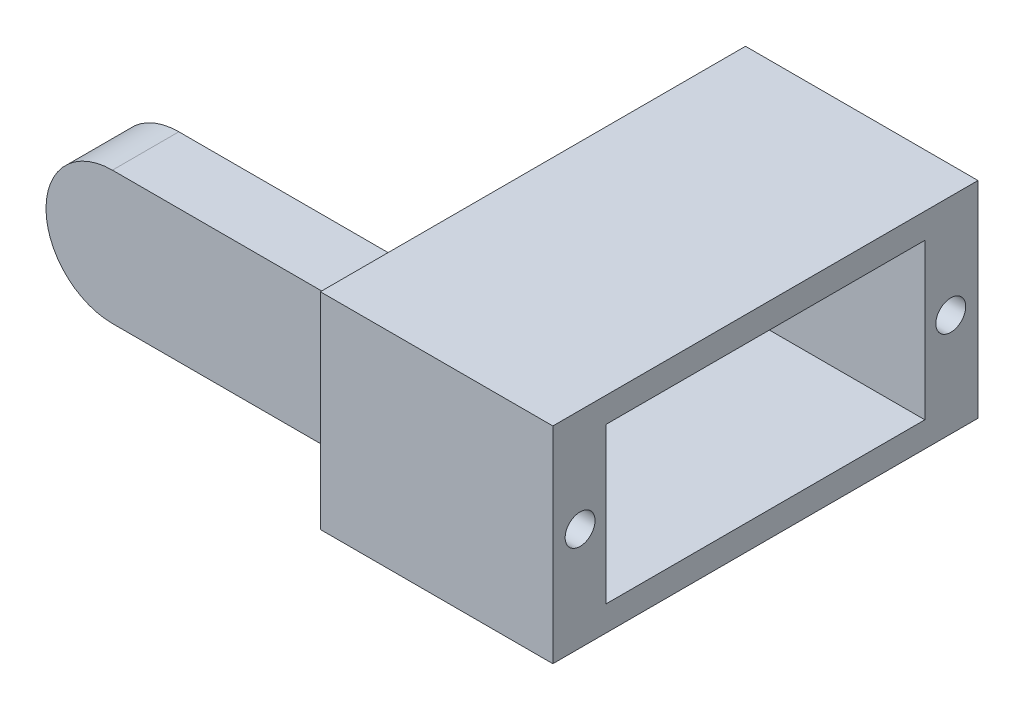
ISO-10303-21;
HEADER;
FILE_DESCRIPTION(('STEP AP214'),'2;1');
FILE_NAME('part.step','',(''),(''),'','','');
FILE_SCHEMA(('AUTOMOTIVE_DESIGN { 1 0 10303 214 1 1 1 1 }'));
ENDSEC;
DATA;
#1=APPLICATION_CONTEXT('core data for automotive mechanical design processes');
#2=APPLICATION_PROTOCOL_DEFINITION('international standard','automotive_design',2000,#1);
#3=PRODUCT_CONTEXT('',#1,'mechanical');
#4=PRODUCT('Part','Part','',(#3));
#5=PRODUCT_RELATED_PRODUCT_CATEGORY('part','',(#4));
#6=PRODUCT_DEFINITION_FORMATION('','',#4);
#7=PRODUCT_DEFINITION_CONTEXT('part definition',#1,'design');
#8=PRODUCT_DEFINITION('design','',#6,#7);
#9=PRODUCT_DEFINITION_SHAPE('','',#8);
#10=(LENGTH_UNIT() NAMED_UNIT(*) SI_UNIT(.MILLI.,.METRE.));
#11=(NAMED_UNIT(*) PLANE_ANGLE_UNIT() SI_UNIT($,.RADIAN.));
#12=(NAMED_UNIT(*) SI_UNIT($,.STERADIAN.) SOLID_ANGLE_UNIT());
#13=UNCERTAINTY_MEASURE_WITH_UNIT(LENGTH_MEASURE(1.E-05),#10,'distance_accuracy_value','');
#14=(GEOMETRIC_REPRESENTATION_CONTEXT(3) GLOBAL_UNCERTAINTY_ASSIGNED_CONTEXT((#13)) GLOBAL_UNIT_ASSIGNED_CONTEXT((#10,
#11,#12)) REPRESENTATION_CONTEXT('',''));
#15=CARTESIAN_POINT('',(0.,0.,0.));
#16=DIRECTION('',(0.,0.,1.));
#17=DIRECTION('',(1.,0.,0.));
#18=AXIS2_PLACEMENT_3D('',#15,#16,#17);
#19=CARTESIAN_POINT('',(0.,-5.,5.));
#20=DIRECTION('',(0.,1.,0.));
#21=DIRECTION('',(0.,0.,1.));
#22=AXIS2_PLACEMENT_3D('',#19,#20,#21);
#23=PLANE('',#22);
#24=DIRECTION('',(0.,0.,-1.));
#25=VECTOR('',#24,1.);
#26=CARTESIAN_POINT('',(18.5,-5.,0.));
#27=LINE('',#26,#25);
#28=CARTESIAN_POINT('',(18.5,-5.,5.));
#29=VERTEX_POINT('',#28);
#30=CARTESIAN_POINT('',(18.5,-5.,0.));
#31=VERTEX_POINT('',#30);
#32=EDGE_CURVE('E180',#29,#31,#27,.T.);
#33=ORIENTED_EDGE('',*,*,#32,.F.);
#34=DIRECTION('',(1.,0.,0.));
#35=VECTOR('',#34,1.);
#36=CARTESIAN_POINT('',(0.,-5.,5.));
#37=LINE('',#36,#35);
#38=CARTESIAN_POINT('',(0.,-5.,5.));
#39=VERTEX_POINT('',#38);
#40=EDGE_CURVE('E201',#39,#29,#37,.T.);
#41=ORIENTED_EDGE('',*,*,#40,.F.);
#42=DIRECTION('',(0.,0.,-1.));
#43=VECTOR('',#42,1.);
#44=CARTESIAN_POINT('',(0.,-5.,5.));
#45=LINE('',#44,#43);
#46=CARTESIAN_POINT('',(0.,-5.,0.));
#47=VERTEX_POINT('',#46);
#48=EDGE_CURVE('E11',#39,#47,#45,.T.);
#49=ORIENTED_EDGE('',*,*,#48,.T.);
#50=DIRECTION('',(1.,0.,0.));
#51=VECTOR('',#50,1.);
#52=CARTESIAN_POINT('',(0.,-5.,0.));
#53=LINE('',#52,#51);
#54=EDGE_CURVE('E208',#47,#31,#53,.T.);
#55=ORIENTED_EDGE('',*,*,#54,.T.);
#56=EDGE_LOOP('',(#33,#41,#49,#55));
#57=FACE_BOUND('',#56,.T.);
#58=ADVANCED_FACE('F38',(#57),#23,.F.);
#59=CARTESIAN_POINT('',(0.,5.,5.));
#60=DIRECTION('',(0.,1.,0.));
#61=DIRECTION('',(0.,0.,1.));
#62=AXIS2_PLACEMENT_3D('',#59,#60,#61);
#63=PLANE('',#62);
#64=DIRECTION('',(1.,0.,0.));
#65=VECTOR('',#64,1.);
#66=CARTESIAN_POINT('',(0.,5.,5.));
#67=LINE('',#66,#65);
#68=CARTESIAN_POINT('',(0.,5.,5.));
#69=VERTEX_POINT('',#68);
#70=CARTESIAN_POINT('',(18.5,5.,5.));
#71=VERTEX_POINT('',#70);
#72=EDGE_CURVE('E204',#69,#71,#67,.T.);
#73=ORIENTED_EDGE('',*,*,#72,.T.);
#74=DIRECTION('',(0.,0.,1.));
#75=VECTOR('',#74,1.);
#76=CARTESIAN_POINT('',(18.5,5.,0.));
#77=LINE('',#76,#75);
#78=CARTESIAN_POINT('',(18.5,5.,0.));
#79=VERTEX_POINT('',#78);
#80=EDGE_CURVE('E141',#79,#71,#77,.T.);
#81=ORIENTED_EDGE('',*,*,#80,.F.);
#82=DIRECTION('',(1.,0.,0.));
#83=VECTOR('',#82,1.);
#84=CARTESIAN_POINT('',(0.,5.,0.));
#85=LINE('',#84,#83);
#86=CARTESIAN_POINT('',(0.,5.,0.));
#87=VERTEX_POINT('',#86);
#88=EDGE_CURVE('E202',#87,#79,#85,.T.);
#89=ORIENTED_EDGE('',*,*,#88,.F.);
#90=DIRECTION('',(0.,0.,-1.));
#91=VECTOR('',#90,1.);
#92=CARTESIAN_POINT('',(0.,5.,5.));
#93=LINE('',#92,#91);
#94=EDGE_CURVE('E46',#69,#87,#93,.T.);
#95=ORIENTED_EDGE('',*,*,#94,.F.);
#96=EDGE_LOOP('',(#73,#81,#89,#95));
#97=FACE_BOUND('',#96,.T.);
#98=ADVANCED_FACE('F220',(#97),#63,.T.);
#99=CARTESIAN_POINT('',(0.,0.,5.));
#100=DIRECTION('',(0.,0.,1.));
#101=DIRECTION('',(1.,0.,0.));
#102=AXIS2_PLACEMENT_3D('',#99,#100,#101);
#103=PLANE('',#102);
#104=ORIENTED_EDGE('',*,*,#40,.T.);
#105=DIRECTION('',(0.,-1.,0.));
#106=VECTOR('',#105,1.);
#107=CARTESIAN_POINT('',(18.5,0.,5.));
#108=LINE('',#107,#106);
#109=EDGE_CURVE('E61',#71,#29,#108,.T.);
#110=ORIENTED_EDGE('',*,*,#109,.F.);
#111=ORIENTED_EDGE('',*,*,#72,.F.);
#112=CARTESIAN_POINT('',(0.,0.,5.));
#113=DIRECTION('',(0.,0.,1.));
#114=DIRECTION('',(1.,0.,0.));
#115=AXIS2_PLACEMENT_3D('',#112,#113,#114);
#116=CIRCLE('',#115,5.);
#117=EDGE_CURVE('E198',#69,#39,#116,.T.);
#118=ORIENTED_EDGE('',*,*,#117,.T.);
#119=EDGE_LOOP('',(#104,#110,#111,#118));
#120=FACE_BOUND('',#119,.T.);
#121=ADVANCED_FACE('F224',(#120),#103,.T.);
#122=CARTESIAN_POINT('',(0.,0.,0.));
#123=DIRECTION('',(0.,0.,1.));
#124=DIRECTION('',(1.,0.,0.));
#125=AXIS2_PLACEMENT_3D('',#122,#123,#124);
#126=PLANE('',#125);
#127=CARTESIAN_POINT('',(0.,0.,0.));
#128=DIRECTION('',(0.,0.,-1.));
#129=DIRECTION('',(-1.,0.,0.));
#130=AXIS2_PLACEMENT_3D('',#127,#128,#129);
#131=CIRCLE('',#130,2.35);
#132=CARTESIAN_POINT('',(-2.35,0.,0.));
#133=VERTEX_POINT('',#132);
#134=EDGE_CURVE('E188',#133,#133,#131,.T.);
#135=ORIENTED_EDGE('',*,*,#134,.F.);
#136=EDGE_LOOP('',(#135));
#137=FACE_BOUND('',#136,.T.);
#138=DIRECTION('',(0.,1.,0.));
#139=VECTOR('',#138,1.);
#140=CARTESIAN_POINT('',(18.5,0.,0.));
#141=LINE('',#140,#139);
#142=EDGE_CURVE('E177',#31,#79,#141,.T.);
#143=ORIENTED_EDGE('',*,*,#142,.F.);
#144=ORIENTED_EDGE('',*,*,#54,.F.);
#145=CARTESIAN_POINT('',(0.,0.,0.));
#146=DIRECTION('',(0.,0.,1.));
#147=DIRECTION('',(1.,0.,0.));
#148=AXIS2_PLACEMENT_3D('',#145,#146,#147);
#149=CIRCLE('',#148,5.);
#150=EDGE_CURVE('E195',#87,#47,#149,.T.);
#151=ORIENTED_EDGE('',*,*,#150,.F.);
#152=ORIENTED_EDGE('',*,*,#88,.T.);
#153=EDGE_LOOP('',(#143,#144,#151,#152));
#154=FACE_BOUND('',#153,.T.);
#155=ADVANCED_FACE('F218',(#137,#154),#126,.F.);
#156=CARTESIAN_POINT('',(0.,0.,5.));
#157=DIRECTION('',(0.,0.,-1.));
#158=DIRECTION('',(-1.,0.,0.));
#159=AXIS2_PLACEMENT_3D('',#156,#157,#158);
#160=CYLINDRICAL_SURFACE('',#159,5.);
#161=ORIENTED_EDGE('',*,*,#150,.T.);
#162=ORIENTED_EDGE('',*,*,#48,.F.);
#163=ORIENTED_EDGE('',*,*,#117,.F.);
#164=ORIENTED_EDGE('',*,*,#94,.T.);
#165=EDGE_LOOP('',(#161,#162,#163,#164));
#166=FACE_BOUND('',#165,.T.);
#167=ADVANCED_FACE('F40',(#166),#160,.T.);
#168=CARTESIAN_POINT('',(0.,0.,3.));
#169=DIRECTION('',(0.,0.,-1.));
#170=DIRECTION('',(-1.,0.,0.));
#171=AXIS2_PLACEMENT_3D('',#168,#169,#170);
#172=CYLINDRICAL_SURFACE('',#171,2.35);
#173=CARTESIAN_POINT('',(0.,0.,3.));
#174=DIRECTION('',(0.,0.,-1.));
#175=DIRECTION('',(-1.,0.,0.));
#176=AXIS2_PLACEMENT_3D('',#173,#174,#175);
#177=CIRCLE('',#176,2.35);
#178=CARTESIAN_POINT('',(-2.35,0.,3.));
#179=VERTEX_POINT('',#178);
#180=EDGE_CURVE('E192',#179,#179,#177,.T.);
#181=ORIENTED_EDGE('',*,*,#180,.F.);
#182=EDGE_LOOP('',(#181));
#183=FACE_BOUND('',#182,.T.);
#184=ORIENTED_EDGE('',*,*,#134,.T.);
#185=EDGE_LOOP('',(#184));
#186=FACE_BOUND('',#185,.T.);
#187=ADVANCED_FACE('F319',(#183,#186),#172,.F.);
#188=CARTESIAN_POINT('',(0.,0.,3.));
#189=DIRECTION('',(0.,0.,-1.));
#190=DIRECTION('',(-1.,0.,0.));
#191=AXIS2_PLACEMENT_3D('',#188,#189,#190);
#192=PLANE('',#191);
#193=ORIENTED_EDGE('',*,*,#180,.T.);
#194=EDGE_LOOP('',(#193));
#195=FACE_BOUND('',#194,.T.);
#196=ADVANCED_FACE('F317',(#195),#192,.T.);
#197=CARTESIAN_POINT('',(18.5,0.,-24.15));
#198=DIRECTION('',(0.,0.,1.));
#199=DIRECTION('',(1.,0.,0.));
#200=AXIS2_PLACEMENT_3D('',#197,#198,#199);
#201=PLANE('',#200);
#202=DIRECTION('',(1.,0.,0.));
#203=VECTOR('',#202,1.);
#204=CARTESIAN_POINT('',(18.5,7.75,-24.15));
#205=LINE('',#204,#203);
#206=CARTESIAN_POINT('',(18.5,7.75,-24.15));
#207=VERTEX_POINT('',#206);
#208=CARTESIAN_POINT('',(36.,7.75,-24.15));
#209=VERTEX_POINT('',#208);
#210=EDGE_CURVE('E131',#207,#209,#205,.T.);
#211=ORIENTED_EDGE('',*,*,#210,.T.);
#212=DIRECTION('',(0.,-1.,0.));
#213=VECTOR('',#212,1.);
#214=CARTESIAN_POINT('',(36.,-7.75000000000001,-24.15));
#215=LINE('',#214,#213);
#216=CARTESIAN_POINT('',(36.,-7.75,-24.15));
#217=VERTEX_POINT('',#216);
#218=EDGE_CURVE('E135',#209,#217,#215,.T.);
#219=ORIENTED_EDGE('',*,*,#218,.T.);
#220=DIRECTION('',(1.,0.,0.));
#221=VECTOR('',#220,1.);
#222=CARTESIAN_POINT('',(18.5,-7.75,-24.15));
#223=LINE('',#222,#221);
#224=CARTESIAN_POINT('',(18.5,-7.75,-24.15));
#225=VERTEX_POINT('',#224);
#226=EDGE_CURVE('E186',#225,#217,#223,.T.);
#227=ORIENTED_EDGE('',*,*,#226,.F.);
#228=DIRECTION('',(0.,-1.,0.));
#229=VECTOR('',#228,1.);
#230=CARTESIAN_POINT('',(18.5,0.,-24.15));
#231=LINE('',#230,#229);
#232=EDGE_CURVE('E136',#207,#225,#231,.T.);
#233=ORIENTED_EDGE('',*,*,#232,.F.);
#234=EDGE_LOOP('',(#211,#219,#227,#233));
#235=FACE_BOUND('',#234,.T.);
#236=ADVANCED_FACE('F133',(#235),#201,.F.);
#237=CARTESIAN_POINT('',(18.5,-7.75,0.));
#238=DIRECTION('',(0.,-1.,0.));
#239=DIRECTION('',(0.,0.,-1.));
#240=AXIS2_PLACEMENT_3D('',#237,#238,#239);
#241=PLANE('',#240);
#242=ORIENTED_EDGE('',*,*,#226,.T.);
#243=DIRECTION('',(0.,0.,1.));
#244=VECTOR('',#243,1.);
#245=CARTESIAN_POINT('',(36.,-7.75,7.85));
#246=LINE('',#245,#244);
#247=CARTESIAN_POINT('',(36.,-7.75,7.85));
#248=VERTEX_POINT('',#247);
#249=EDGE_CURVE('E151',#217,#248,#246,.T.);
#250=ORIENTED_EDGE('',*,*,#249,.T.);
#251=DIRECTION('',(1.,0.,0.));
#252=VECTOR('',#251,1.);
#253=CARTESIAN_POINT('',(18.5,-7.75,7.85));
#254=LINE('',#253,#252);
#255=CARTESIAN_POINT('',(18.5,-7.75,7.85));
#256=VERTEX_POINT('',#255);
#257=EDGE_CURVE('E189',#256,#248,#254,.T.);
#258=ORIENTED_EDGE('',*,*,#257,.F.);
#259=DIRECTION('',(0.,0.,-1.));
#260=VECTOR('',#259,1.);
#261=CARTESIAN_POINT('',(18.5,-7.75,0.));
#262=LINE('',#261,#260);
#263=EDGE_CURVE('E174',#256,#225,#262,.T.);
#264=ORIENTED_EDGE('',*,*,#263,.T.);
#265=EDGE_LOOP('',(#242,#250,#258,#264));
#266=FACE_BOUND('',#265,.T.);
#267=ADVANCED_FACE('F305',(#266),#241,.T.);
#268=CARTESIAN_POINT('',(18.5,0.,7.85));
#269=DIRECTION('',(0.,0.,1.));
#270=DIRECTION('',(0.,-1.,0.));
#271=AXIS2_PLACEMENT_3D('',#268,#269,#270);
#272=PLANE('',#271);
#273=ORIENTED_EDGE('',*,*,#257,.T.);
#274=DIRECTION('',(0.,1.,0.));
#275=VECTOR('',#274,1.);
#276=CARTESIAN_POINT('',(36.,7.74999999999999,7.85));
#277=LINE('',#276,#275);
#278=CARTESIAN_POINT('',(36.,7.75,7.85));
#279=VERTEX_POINT('',#278);
#280=EDGE_CURVE('E154',#248,#279,#277,.T.);
#281=ORIENTED_EDGE('',*,*,#280,.T.);
#282=DIRECTION('',(1.,0.,0.));
#283=VECTOR('',#282,1.);
#284=CARTESIAN_POINT('',(18.5,7.75,7.85));
#285=LINE('',#284,#283);
#286=CARTESIAN_POINT('',(18.5,7.75,7.85));
#287=VERTEX_POINT('',#286);
#288=EDGE_CURVE('E140',#287,#279,#285,.T.);
#289=ORIENTED_EDGE('',*,*,#288,.F.);
#290=DIRECTION('',(0.,-1.,0.));
#291=VECTOR('',#290,1.);
#292=CARTESIAN_POINT('',(18.5,0.,7.85));
#293=LINE('',#292,#291);
#294=EDGE_CURVE('E171',#287,#256,#293,.T.);
#295=ORIENTED_EDGE('',*,*,#294,.T.);
#296=EDGE_LOOP('',(#273,#281,#289,#295));
#297=FACE_BOUND('',#296,.T.);
#298=ADVANCED_FACE('F308',(#297),#272,.T.);
#299=CARTESIAN_POINT('',(18.5,7.75,0.));
#300=DIRECTION('',(0.,-1.,0.));
#301=DIRECTION('',(0.,0.,-1.));
#302=AXIS2_PLACEMENT_3D('',#299,#300,#301);
#303=PLANE('',#302);
#304=ORIENTED_EDGE('',*,*,#288,.T.);
#305=DIRECTION('',(0.,0.,-1.));
#306=VECTOR('',#305,1.);
#307=CARTESIAN_POINT('',(36.,7.75,-24.15));
#308=LINE('',#307,#306);
#309=EDGE_CURVE('E148',#279,#209,#308,.T.);
#310=ORIENTED_EDGE('',*,*,#309,.T.);
#311=ORIENTED_EDGE('',*,*,#210,.F.);
#312=DIRECTION('',(0.,0.,-1.));
#313=VECTOR('',#312,1.);
#314=CARTESIAN_POINT('',(18.5,7.75,0.));
#315=LINE('',#314,#313);
#316=EDGE_CURVE('E169',#287,#207,#315,.T.);
#317=ORIENTED_EDGE('',*,*,#316,.F.);
#318=EDGE_LOOP('',(#304,#310,#311,#317));
#319=FACE_BOUND('',#318,.T.);
#320=ADVANCED_FACE('F153',(#319),#303,.F.);
#321=CARTESIAN_POINT('',(18.5,0.,0.));
#322=DIRECTION('',(1.,0.,0.));
#323=DIRECTION('',(0.,0.,-1.));
#324=AXIS2_PLACEMENT_3D('',#321,#322,#323);
#325=PLANE('',#324);
#326=ORIENTED_EDGE('',*,*,#232,.T.);
#327=ORIENTED_EDGE('',*,*,#263,.F.);
#328=ORIENTED_EDGE('',*,*,#294,.F.);
#329=ORIENTED_EDGE('',*,*,#316,.T.);
#330=EDGE_LOOP('',(#326,#327,#328,#329));
#331=FACE_BOUND('',#330,.T.);
#332=ORIENTED_EDGE('',*,*,#142,.T.);
#333=ORIENTED_EDGE('',*,*,#80,.T.);
#334=ORIENTED_EDGE('',*,*,#109,.T.);
#335=ORIENTED_EDGE('',*,*,#32,.T.);
#336=EDGE_LOOP('',(#332,#333,#334,#335));
#337=FACE_BOUND('',#336,.T.);
#338=ADVANCED_FACE('F222',(#331,#337),#325,.F.);
#339=CARTESIAN_POINT('',(71.556293395122,5.85,-20.15));
#340=DIRECTION('',(0.,-1.,0.));
#341=DIRECTION('',(0.,0.,-1.));
#342=AXIS2_PLACEMENT_3D('',#339,#340,#341);
#343=PLANE('',#342);
#344=DIRECTION('',(0.,0.,-1.));
#345=VECTOR('',#344,1.);
#346=CARTESIAN_POINT('',(36.,5.85,-20.15));
#347=LINE('',#346,#345);
#348=CARTESIAN_POINT('',(36.,5.85,3.85));
#349=VERTEX_POINT('',#348);
#350=CARTESIAN_POINT('',(36.,5.85,-20.15));
#351=VERTEX_POINT('',#350);
#352=EDGE_CURVE('E160',#349,#351,#347,.T.);
#353=ORIENTED_EDGE('',*,*,#352,.F.);
#354=DIRECTION('',(-1.,0.,0.));
#355=VECTOR('',#354,1.);
#356=CARTESIAN_POINT('',(71.556293395122,5.85,3.85));
#357=LINE('',#356,#355);
#358=CARTESIAN_POINT('',(20.9,5.85,3.85));
#359=VERTEX_POINT('',#358);
#360=EDGE_CURVE('E156',#349,#359,#357,.T.);
#361=ORIENTED_EDGE('',*,*,#360,.T.);
#362=DIRECTION('',(0.,0.,1.));
#363=VECTOR('',#362,1.);
#364=CARTESIAN_POINT('',(20.9,5.85,-20.15));
#365=LINE('',#364,#363);
#366=CARTESIAN_POINT('',(20.9,5.85,-20.15));
#367=VERTEX_POINT('',#366);
#368=EDGE_CURVE('E53',#367,#359,#365,.T.);
#369=ORIENTED_EDGE('',*,*,#368,.F.);
#370=DIRECTION('',(-1.,0.,0.));
#371=VECTOR('',#370,1.);
#372=CARTESIAN_POINT('',(71.556293395122,5.85,-20.15));
#373=LINE('',#372,#371);
#374=EDGE_CURVE('E163',#351,#367,#373,.T.);
#375=ORIENTED_EDGE('',*,*,#374,.F.);
#376=EDGE_LOOP('',(#353,#361,#369,#375));
#377=FACE_BOUND('',#376,.T.);
#378=ADVANCED_FACE('F280',(#377),#343,.T.);
#379=CARTESIAN_POINT('',(71.556293395122,5.85,3.85));
#380=DIRECTION('',(0.,0.,-1.));
#381=DIRECTION('',(-1.,0.,0.));
#382=AXIS2_PLACEMENT_3D('',#379,#380,#381);
#383=PLANE('',#382);
#384=DIRECTION('',(0.,1.,0.));
#385=VECTOR('',#384,1.);
#386=CARTESIAN_POINT('',(36.,5.85,3.85));
#387=LINE('',#386,#385);
#388=CARTESIAN_POINT('',(36.,-5.85,3.85));
#389=VERTEX_POINT('',#388);
#390=EDGE_CURVE('E164',#389,#349,#387,.T.);
#391=ORIENTED_EDGE('',*,*,#390,.F.);
#392=DIRECTION('',(-1.,0.,0.));
#393=VECTOR('',#392,1.);
#394=CARTESIAN_POINT('',(71.556293395122,-5.85,3.85));
#395=LINE('',#394,#393);
#396=CARTESIAN_POINT('',(20.9,-5.85,3.85));
#397=VERTEX_POINT('',#396);
#398=EDGE_CURVE('E274',#389,#397,#395,.T.);
#399=ORIENTED_EDGE('',*,*,#398,.T.);
#400=DIRECTION('',(0.,-1.,0.));
#401=VECTOR('',#400,1.);
#402=CARTESIAN_POINT('',(20.9,5.85,3.85));
#403=LINE('',#402,#401);
#404=EDGE_CURVE('E263',#359,#397,#403,.T.);
#405=ORIENTED_EDGE('',*,*,#404,.F.);
#406=ORIENTED_EDGE('',*,*,#360,.F.);
#407=EDGE_LOOP('',(#391,#399,#405,#406));
#408=FACE_BOUND('',#407,.T.);
#409=ADVANCED_FACE('F286',(#408),#383,.T.);
#410=CARTESIAN_POINT('',(71.556293395122,-5.85,3.85));
#411=DIRECTION('',(0.,1.,0.));
#412=DIRECTION('',(0.,0.,1.));
#413=AXIS2_PLACEMENT_3D('',#410,#411,#412);
#414=PLANE('',#413);
#415=DIRECTION('',(0.,0.,1.));
#416=VECTOR('',#415,1.);
#417=CARTESIAN_POINT('',(36.,-5.85,3.85));
#418=LINE('',#417,#416);
#419=CARTESIAN_POINT('',(36.,-5.85,-20.15));
#420=VERTEX_POINT('',#419);
#421=EDGE_CURVE('E166',#420,#389,#418,.T.);
#422=ORIENTED_EDGE('',*,*,#421,.F.);
#423=DIRECTION('',(-1.,0.,0.));
#424=VECTOR('',#423,1.);
#425=CARTESIAN_POINT('',(71.556293395122,-5.85,-20.15));
#426=LINE('',#425,#424);
#427=CARTESIAN_POINT('',(20.9,-5.85,-20.15));
#428=VERTEX_POINT('',#427);
#429=EDGE_CURVE('E276',#420,#428,#426,.T.);
#430=ORIENTED_EDGE('',*,*,#429,.T.);
#431=DIRECTION('',(0.,0.,-1.));
#432=VECTOR('',#431,1.);
#433=CARTESIAN_POINT('',(20.9,-5.85,3.85));
#434=LINE('',#433,#432);
#435=EDGE_CURVE('E259',#397,#428,#434,.T.);
#436=ORIENTED_EDGE('',*,*,#435,.F.);
#437=ORIENTED_EDGE('',*,*,#398,.F.);
#438=EDGE_LOOP('',(#422,#430,#436,#437));
#439=FACE_BOUND('',#438,.T.);
#440=ADVANCED_FACE('F290',(#439),#414,.T.);
#441=CARTESIAN_POINT('',(71.556293395122,-5.85,-20.15));
#442=DIRECTION('',(0.,0.,1.));
#443=DIRECTION('',(1.,0.,0.));
#444=AXIS2_PLACEMENT_3D('',#441,#442,#443);
#445=PLANE('',#444);
#446=DIRECTION('',(0.,-1.,0.));
#447=VECTOR('',#446,1.);
#448=CARTESIAN_POINT('',(36.,-5.85,-20.15));
#449=LINE('',#448,#447);
#450=EDGE_CURVE('E162',#351,#420,#449,.T.);
#451=ORIENTED_EDGE('',*,*,#450,.F.);
#452=ORIENTED_EDGE('',*,*,#374,.T.);
#453=DIRECTION('',(0.,1.,0.));
#454=VECTOR('',#453,1.);
#455=CARTESIAN_POINT('',(20.9,-5.85,-20.15));
#456=LINE('',#455,#454);
#457=EDGE_CURVE('E256',#428,#367,#456,.T.);
#458=ORIENTED_EDGE('',*,*,#457,.F.);
#459=ORIENTED_EDGE('',*,*,#429,.F.);
#460=EDGE_LOOP('',(#451,#452,#458,#459));
#461=FACE_BOUND('',#460,.T.);
#462=ADVANCED_FACE('F250',(#461),#445,.T.);
#463=CARTESIAN_POINT('',(36.,0.,-8.15));
#464=DIRECTION('',(-1.,0.,0.));
#465=DIRECTION('',(0.,0.,1.));
#466=AXIS2_PLACEMENT_3D('',#463,#464,#465);
#467=PLANE('',#466);
#468=CARTESIAN_POINT('',(36.,0.,5.80000000000001));
#469=DIRECTION('',(1.,0.,0.));
#470=DIRECTION('',(0.,0.,-1.));
#471=AXIS2_PLACEMENT_3D('',#468,#469,#470);
#472=CIRCLE('',#471,1.125);
#473=CARTESIAN_POINT('',(36.,0.,4.67500000000001));
#474=VERTEX_POINT('',#473);
#475=EDGE_CURVE('E447',#474,#474,#472,.T.);
#476=ORIENTED_EDGE('',*,*,#475,.F.);
#477=EDGE_LOOP('',(#476));
#478=FACE_BOUND('',#477,.T.);
#479=CARTESIAN_POINT('',(36.,0.,-22.1));
#480=DIRECTION('',(1.,0.,0.));
#481=DIRECTION('',(0.,0.,-1.));
#482=AXIS2_PLACEMENT_3D('',#479,#480,#481);
#483=CIRCLE('',#482,1.125);
#484=CARTESIAN_POINT('',(36.,0.,-23.225));
#485=VERTEX_POINT('',#484);
#486=EDGE_CURVE('E266',#485,#485,#483,.T.);
#487=ORIENTED_EDGE('',*,*,#486,.F.);
#488=EDGE_LOOP('',(#487));
#489=FACE_BOUND('',#488,.T.);
#490=ORIENTED_EDGE('',*,*,#352,.T.);
#491=ORIENTED_EDGE('',*,*,#450,.T.);
#492=ORIENTED_EDGE('',*,*,#421,.T.);
#493=ORIENTED_EDGE('',*,*,#390,.T.);
#494=EDGE_LOOP('',(#490,#491,#492,#493));
#495=FACE_BOUND('',#494,.T.);
#496=ORIENTED_EDGE('',*,*,#218,.F.);
#497=ORIENTED_EDGE('',*,*,#309,.F.);
#498=ORIENTED_EDGE('',*,*,#280,.F.);
#499=ORIENTED_EDGE('',*,*,#249,.F.);
#500=EDGE_LOOP('',(#496,#497,#498,#499));
#501=FACE_BOUND('',#500,.T.);
#502=ADVANCED_FACE('F146',(#478,#489,#495,#501),#467,.F.);
#503=CARTESIAN_POINT('',(20.9,-5.,5.));
#504=DIRECTION('',(-1.,0.,0.));
#505=DIRECTION('',(0.,0.,1.));
#506=AXIS2_PLACEMENT_3D('',#503,#504,#505);
#507=PLANE('',#506);
#508=ORIENTED_EDGE('',*,*,#457,.T.);
#509=ORIENTED_EDGE('',*,*,#368,.T.);
#510=ORIENTED_EDGE('',*,*,#404,.T.);
#511=ORIENTED_EDGE('',*,*,#435,.T.);
#512=EDGE_LOOP('',(#508,#509,#510,#511));
#513=FACE_BOUND('',#512,.T.);
#514=ADVANCED_FACE('F239',(#513),#507,.F.);
#515=CARTESIAN_POINT('',(28.,0.,-22.1));
#516=DIRECTION('',(1.,0.,0.));
#517=DIRECTION('',(0.,0.,-1.));
#518=AXIS2_PLACEMENT_3D('',#515,#516,#517);
#519=CYLINDRICAL_SURFACE('',#518,1.125);
#520=CARTESIAN_POINT('',(28.,0.,-22.1));
#521=DIRECTION('',(1.,0.,0.));
#522=DIRECTION('',(0.,0.,-1.));
#523=AXIS2_PLACEMENT_3D('',#520,#521,#522);
#524=CIRCLE('',#523,1.125);
#525=CARTESIAN_POINT('',(28.,0.,-23.225));
#526=VERTEX_POINT('',#525);
#527=EDGE_CURVE('E450',#526,#526,#524,.T.);
#528=ORIENTED_EDGE('',*,*,#527,.F.);
#529=EDGE_LOOP('',(#528));
#530=FACE_BOUND('',#529,.T.);
#531=ORIENTED_EDGE('',*,*,#486,.T.);
#532=EDGE_LOOP('',(#531));
#533=FACE_BOUND('',#532,.T.);
#534=ADVANCED_FACE('F241',(#530,#533),#519,.F.);
#535=CARTESIAN_POINT('',(28.,0.,-22.1));
#536=DIRECTION('',(1.,0.,0.));
#537=DIRECTION('',(0.,0.,-1.));
#538=AXIS2_PLACEMENT_3D('',#535,#536,#537);
#539=PLANE('',#538);
#540=ORIENTED_EDGE('',*,*,#527,.T.);
#541=EDGE_LOOP('',(#540));
#542=FACE_BOUND('',#541,.T.);
#543=ADVANCED_FACE('F247',(#542),#539,.T.);
#544=CARTESIAN_POINT('',(28.,0.,5.8));
#545=DIRECTION('',(1.,0.,0.));
#546=DIRECTION('',(0.,0.,-1.));
#547=AXIS2_PLACEMENT_3D('',#544,#545,#546);
#548=CYLINDRICAL_SURFACE('',#547,1.125);
#549=CARTESIAN_POINT('',(28.,0.,5.8));
#550=DIRECTION('',(1.,0.,0.));
#551=DIRECTION('',(0.,0.,-1.));
#552=AXIS2_PLACEMENT_3D('',#549,#550,#551);
#553=CIRCLE('',#552,1.125);
#554=CARTESIAN_POINT('',(28.,0.,4.675));
#555=VERTEX_POINT('',#554);
#556=EDGE_CURVE('E271',#555,#555,#553,.T.);
#557=ORIENTED_EDGE('',*,*,#556,.F.);
#558=EDGE_LOOP('',(#557));
#559=FACE_BOUND('',#558,.T.);
#560=ORIENTED_EDGE('',*,*,#475,.T.);
#561=EDGE_LOOP('',(#560));
#562=FACE_BOUND('',#561,.T.);
#563=ADVANCED_FACE('F421',(#559,#562),#548,.F.);
#564=CARTESIAN_POINT('',(28.,0.,5.8));
#565=DIRECTION('',(1.,0.,0.));
#566=DIRECTION('',(0.,0.,-1.));
#567=AXIS2_PLACEMENT_3D('',#564,#565,#566);
#568=PLANE('',#567);
#569=ORIENTED_EDGE('',*,*,#556,.T.);
#570=EDGE_LOOP('',(#569));
#571=FACE_BOUND('',#570,.T.);
#572=ADVANCED_FACE('F431',(#571),#568,.T.);
#573=CLOSED_SHELL('',(#58,#98,#121,#155,#167,#187,#196,#236,#267,#298,#320,#338,#378,#409,#440,
#462,#502,#514,#534,#543,#563,#572));
#574=MANIFOLD_SOLID_BREP('B2',#573);
#575=ADVANCED_BREP_SHAPE_REPRESENTATION('',(#18,#574),#14);
#576=SHAPE_DEFINITION_REPRESENTATION(#9,#575);
ENDSEC;
END-ISO-10303-21;
